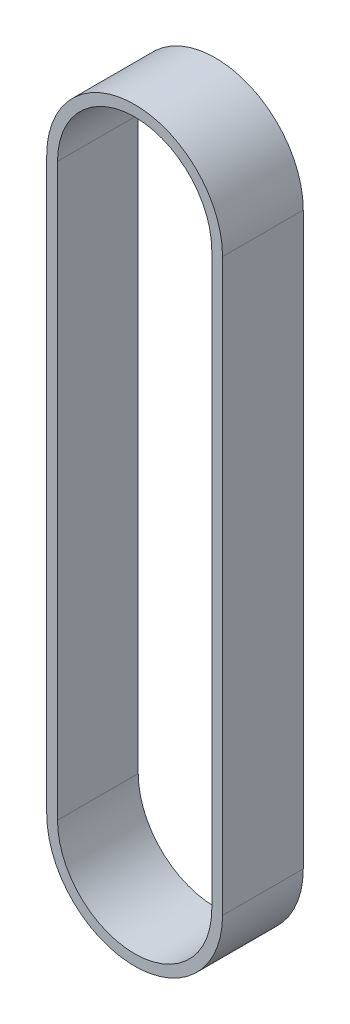
ISO-10303-21;
HEADER;
FILE_DESCRIPTION(('STEP AP214'),'2;1');
FILE_NAME('part.step','',(''),(''),'','','');
FILE_SCHEMA(('AUTOMOTIVE_DESIGN { 1 0 10303 214 1 1 1 1 }'));
ENDSEC;
DATA;
#1=APPLICATION_CONTEXT('core data for automotive mechanical design processes');
#2=APPLICATION_PROTOCOL_DEFINITION('international standard','automotive_design',2000,#1);
#3=PRODUCT_CONTEXT('',#1,'mechanical');
#4=PRODUCT('Part','Part','',(#3));
#5=PRODUCT_RELATED_PRODUCT_CATEGORY('part','',(#4));
#6=PRODUCT_DEFINITION_FORMATION('','',#4);
#7=PRODUCT_DEFINITION_CONTEXT('part definition',#1,'design');
#8=PRODUCT_DEFINITION('design','',#6,#7);
#9=PRODUCT_DEFINITION_SHAPE('','',#8);
#10=(LENGTH_UNIT() NAMED_UNIT(*) SI_UNIT(.MILLI.,.METRE.));
#11=(NAMED_UNIT(*) PLANE_ANGLE_UNIT() SI_UNIT($,.RADIAN.));
#12=(NAMED_UNIT(*) SI_UNIT($,.STERADIAN.) SOLID_ANGLE_UNIT());
#13=UNCERTAINTY_MEASURE_WITH_UNIT(LENGTH_MEASURE(1.E-05),#10,'distance_accuracy_value','');
#14=(GEOMETRIC_REPRESENTATION_CONTEXT(3) GLOBAL_UNCERTAINTY_ASSIGNED_CONTEXT((#13)) GLOBAL_UNIT_ASSIGNED_CONTEXT((#10,
#11,#12)) REPRESENTATION_CONTEXT('',''));
#15=CARTESIAN_POINT('',(0.,0.,0.));
#16=DIRECTION('',(0.,0.,1.));
#17=DIRECTION('',(1.,0.,0.));
#18=AXIS2_PLACEMENT_3D('',#15,#16,#17);
#19=CARTESIAN_POINT('',(0.,-53.,7.5));
#20=DIRECTION('',(0.,0.,1.));
#21=DIRECTION('',(1.,0.,0.));
#22=AXIS2_PLACEMENT_3D('',#19,#20,#21);
#23=PLANE('',#22);
#24=CARTESIAN_POINT('',(0.,-53.,7.5));
#25=DIRECTION('',(0.,0.,1.));
#26=DIRECTION('',(1.,0.,0.));
#27=AXIS2_PLACEMENT_3D('',#24,#25,#26);
#28=CIRCLE('',#27,16.33);
#29=CARTESIAN_POINT('',(-16.33,-53.,7.5));
#30=VERTEX_POINT('',#29);
#31=CARTESIAN_POINT('',(16.33,-53.,7.5));
#32=VERTEX_POINT('',#31);
#33=EDGE_CURVE('E159',#30,#32,#28,.T.);
#34=ORIENTED_EDGE('',*,*,#33,.T.);
#35=DIRECTION('',(0.,1.,0.));
#36=VECTOR('',#35,1.);
#37=CARTESIAN_POINT('',(16.33,-53.,7.5));
#38=LINE('',#37,#36);
#39=CARTESIAN_POINT('',(16.33,53.,7.5));
#40=VERTEX_POINT('',#39);
#41=EDGE_CURVE('E162',#32,#40,#38,.T.);
#42=ORIENTED_EDGE('',*,*,#41,.T.);
#43=CARTESIAN_POINT('',(0.,53.,7.5));
#44=DIRECTION('',(0.,0.,1.));
#45=DIRECTION('',(1.,0.,0.));
#46=AXIS2_PLACEMENT_3D('',#43,#44,#45);
#47=CIRCLE('',#46,16.33);
#48=CARTESIAN_POINT('',(-16.33,53.,7.5));
#49=VERTEX_POINT('',#48);
#50=EDGE_CURVE('E165',#40,#49,#47,.T.);
#51=ORIENTED_EDGE('',*,*,#50,.T.);
#52=DIRECTION('',(0.,-1.,0.));
#53=VECTOR('',#52,1.);
#54=CARTESIAN_POINT('',(-16.33,-53.,7.5));
#55=LINE('',#54,#53);
#56=EDGE_CURVE('E167',#49,#30,#55,.T.);
#57=ORIENTED_EDGE('',*,*,#56,.T.);
#58=EDGE_LOOP('',(#34,#42,#51,#57));
#59=FACE_BOUND('',#58,.T.);
#60=DIRECTION('',(0.,1.,0.));
#61=VECTOR('',#60,1.);
#62=CARTESIAN_POINT('',(14.33,-53.,7.5));
#63=LINE('',#62,#61);
#64=CARTESIAN_POINT('',(14.33,-53.,7.5));
#65=VERTEX_POINT('',#64);
#66=CARTESIAN_POINT('',(14.33,53.,7.5));
#67=VERTEX_POINT('',#66);
#68=EDGE_CURVE('E131',#65,#67,#63,.T.);
#69=ORIENTED_EDGE('',*,*,#68,.F.);
#70=CARTESIAN_POINT('',(0.,-53.,7.5));
#71=DIRECTION('',(0.,0.,1.));
#72=DIRECTION('',(1.,0.,0.));
#73=AXIS2_PLACEMENT_3D('',#70,#71,#72);
#74=CIRCLE('',#73,14.33);
#75=CARTESIAN_POINT('',(-14.33,-53.,7.5));
#76=VERTEX_POINT('',#75);
#77=EDGE_CURVE('E123',#76,#65,#74,.T.);
#78=ORIENTED_EDGE('',*,*,#77,.F.);
#79=DIRECTION('',(0.,-1.,0.));
#80=VECTOR('',#79,1.);
#81=CARTESIAN_POINT('',(-14.33,-53.,7.5));
#82=LINE('',#81,#80);
#83=CARTESIAN_POINT('',(-14.33,53.,7.5));
#84=VERTEX_POINT('',#83);
#85=EDGE_CURVE('E145',#84,#76,#82,.T.);
#86=ORIENTED_EDGE('',*,*,#85,.F.);
#87=CARTESIAN_POINT('',(0.,53.,7.5));
#88=DIRECTION('',(0.,0.,1.));
#89=DIRECTION('',(1.,0.,0.));
#90=AXIS2_PLACEMENT_3D('',#87,#88,#89);
#91=CIRCLE('',#90,14.33);
#92=EDGE_CURVE('E143',#67,#84,#91,.T.);
#93=ORIENTED_EDGE('',*,*,#92,.F.);
#94=EDGE_LOOP('',(#69,#78,#86,#93));
#95=FACE_BOUND('',#94,.T.);
#96=ADVANCED_FACE('F58',(#59,#95),#23,.T.);
#97=CARTESIAN_POINT('',(0.,-53.,-7.5));
#98=DIRECTION('',(0.,0.,1.));
#99=DIRECTION('',(1.,0.,0.));
#100=AXIS2_PLACEMENT_3D('',#97,#98,#99);
#101=PLANE('',#100);
#102=CARTESIAN_POINT('',(0.,-53.,-7.5));
#103=DIRECTION('',(0.,0.,1.));
#104=DIRECTION('',(1.,0.,0.));
#105=AXIS2_PLACEMENT_3D('',#102,#103,#104);
#106=CIRCLE('',#105,16.33);
#107=CARTESIAN_POINT('',(-16.33,-53.,-7.5));
#108=VERTEX_POINT('',#107);
#109=CARTESIAN_POINT('',(16.33,-53.,-7.5));
#110=VERTEX_POINT('',#109);
#111=EDGE_CURVE('E139',#108,#110,#106,.T.);
#112=ORIENTED_EDGE('',*,*,#111,.F.);
#113=DIRECTION('',(0.,-1.,0.));
#114=VECTOR('',#113,1.);
#115=CARTESIAN_POINT('',(-16.33,-53.,-7.5));
#116=LINE('',#115,#114);
#117=CARTESIAN_POINT('',(-16.33,53.,-7.5));
#118=VERTEX_POINT('',#117);
#119=EDGE_CURVE('E163',#118,#108,#116,.T.);
#120=ORIENTED_EDGE('',*,*,#119,.F.);
#121=CARTESIAN_POINT('',(0.,53.,-7.5));
#122=DIRECTION('',(0.,0.,1.));
#123=DIRECTION('',(1.,0.,0.));
#124=AXIS2_PLACEMENT_3D('',#121,#122,#123);
#125=CIRCLE('',#124,16.33);
#126=CARTESIAN_POINT('',(16.33,53.,-7.5));
#127=VERTEX_POINT('',#126);
#128=EDGE_CURVE('E174',#127,#118,#125,.T.);
#129=ORIENTED_EDGE('',*,*,#128,.F.);
#130=DIRECTION('',(0.,1.,0.));
#131=VECTOR('',#130,1.);
#132=CARTESIAN_POINT('',(16.33,-53.,-7.5));
#133=LINE('',#132,#131);
#134=EDGE_CURVE('E172',#110,#127,#133,.T.);
#135=ORIENTED_EDGE('',*,*,#134,.F.);
#136=EDGE_LOOP('',(#112,#120,#129,#135));
#137=FACE_BOUND('',#136,.T.);
#138=CARTESIAN_POINT('',(0.,-53.,-7.5));
#139=DIRECTION('',(0.,0.,1.));
#140=DIRECTION('',(1.,0.,0.));
#141=AXIS2_PLACEMENT_3D('',#138,#139,#140);
#142=CIRCLE('',#141,14.33);
#143=CARTESIAN_POINT('',(-14.33,-53.,-7.5));
#144=VERTEX_POINT('',#143);
#145=CARTESIAN_POINT('',(14.33,-53.,-7.5));
#146=VERTEX_POINT('',#145);
#147=EDGE_CURVE('E81',#144,#146,#142,.T.);
#148=ORIENTED_EDGE('',*,*,#147,.T.);
#149=DIRECTION('',(0.,1.,0.));
#150=VECTOR('',#149,1.);
#151=CARTESIAN_POINT('',(14.33,-53.,-7.5));
#152=LINE('',#151,#150);
#153=CARTESIAN_POINT('',(14.33,53.,-7.5));
#154=VERTEX_POINT('',#153);
#155=EDGE_CURVE('E138',#146,#154,#152,.T.);
#156=ORIENTED_EDGE('',*,*,#155,.T.);
#157=CARTESIAN_POINT('',(0.,53.,-7.5));
#158=DIRECTION('',(0.,0.,1.));
#159=DIRECTION('',(1.,0.,0.));
#160=AXIS2_PLACEMENT_3D('',#157,#158,#159);
#161=CIRCLE('',#160,14.33);
#162=CARTESIAN_POINT('',(-14.33,53.,-7.5));
#163=VERTEX_POINT('',#162);
#164=EDGE_CURVE('E151',#154,#163,#161,.T.);
#165=ORIENTED_EDGE('',*,*,#164,.T.);
#166=DIRECTION('',(0.,-1.,0.));
#167=VECTOR('',#166,1.);
#168=CARTESIAN_POINT('',(-14.33,-53.,-7.5));
#169=LINE('',#168,#167);
#170=EDGE_CURVE('E132',#163,#144,#169,.T.);
#171=ORIENTED_EDGE('',*,*,#170,.T.);
#172=EDGE_LOOP('',(#148,#156,#165,#171));
#173=FACE_BOUND('',#172,.T.);
#174=ADVANCED_FACE('F192',(#137,#173),#101,.F.);
#175=CARTESIAN_POINT('',(0.,-53.,7.5));
#176=DIRECTION('',(0.,0.,-1.));
#177=DIRECTION('',(-1.,0.,0.));
#178=AXIS2_PLACEMENT_3D('',#175,#176,#177);
#179=CYLINDRICAL_SURFACE('',#178,16.33);
#180=ORIENTED_EDGE('',*,*,#111,.T.);
#181=DIRECTION('',(0.,0.,-1.));
#182=VECTOR('',#181,1.);
#183=CARTESIAN_POINT('',(16.33,-53.,7.5));
#184=LINE('',#183,#182);
#185=EDGE_CURVE('E12',#32,#110,#184,.T.);
#186=ORIENTED_EDGE('',*,*,#185,.F.);
#187=ORIENTED_EDGE('',*,*,#33,.F.);
#188=DIRECTION('',(0.,0.,-1.));
#189=VECTOR('',#188,1.);
#190=CARTESIAN_POINT('',(-16.33,-53.,7.5));
#191=LINE('',#190,#189);
#192=EDGE_CURVE('E169',#30,#108,#191,.T.);
#193=ORIENTED_EDGE('',*,*,#192,.T.);
#194=EDGE_LOOP('',(#180,#186,#187,#193));
#195=FACE_BOUND('',#194,.T.);
#196=ADVANCED_FACE('F60',(#195),#179,.T.);
#197=CARTESIAN_POINT('',(16.33,-53.,7.5));
#198=DIRECTION('',(-1.,0.,0.));
#199=DIRECTION('',(0.,-1.,0.));
#200=AXIS2_PLACEMENT_3D('',#197,#198,#199);
#201=PLANE('',#200);
#202=ORIENTED_EDGE('',*,*,#134,.T.);
#203=DIRECTION('',(0.,0.,-1.));
#204=VECTOR('',#203,1.);
#205=CARTESIAN_POINT('',(16.33,53.,7.5));
#206=LINE('',#205,#204);
#207=EDGE_CURVE('E66',#40,#127,#206,.T.);
#208=ORIENTED_EDGE('',*,*,#207,.F.);
#209=ORIENTED_EDGE('',*,*,#41,.F.);
#210=ORIENTED_EDGE('',*,*,#185,.T.);
#211=EDGE_LOOP('',(#202,#208,#209,#210));
#212=FACE_BOUND('',#211,.T.);
#213=ADVANCED_FACE('F202',(#212),#201,.F.);
#214=CARTESIAN_POINT('',(0.,53.,7.5));
#215=DIRECTION('',(0.,0.,-1.));
#216=DIRECTION('',(-1.,0.,0.));
#217=AXIS2_PLACEMENT_3D('',#214,#215,#216);
#218=CYLINDRICAL_SURFACE('',#217,16.33);
#219=ORIENTED_EDGE('',*,*,#128,.T.);
#220=DIRECTION('',(0.,0.,-1.));
#221=VECTOR('',#220,1.);
#222=CARTESIAN_POINT('',(-16.33,53.,7.5));
#223=LINE('',#222,#221);
#224=EDGE_CURVE('E179',#49,#118,#223,.T.);
#225=ORIENTED_EDGE('',*,*,#224,.F.);
#226=ORIENTED_EDGE('',*,*,#50,.F.);
#227=ORIENTED_EDGE('',*,*,#207,.T.);
#228=EDGE_LOOP('',(#219,#225,#226,#227));
#229=FACE_BOUND('',#228,.T.);
#230=ADVANCED_FACE('F186',(#229),#218,.T.);
#231=CARTESIAN_POINT('',(-16.33,-53.,7.5));
#232=DIRECTION('',(1.,0.,0.));
#233=DIRECTION('',(0.,1.,0.));
#234=AXIS2_PLACEMENT_3D('',#231,#232,#233);
#235=PLANE('',#234);
#236=ORIENTED_EDGE('',*,*,#119,.T.);
#237=ORIENTED_EDGE('',*,*,#192,.F.);
#238=ORIENTED_EDGE('',*,*,#56,.F.);
#239=ORIENTED_EDGE('',*,*,#224,.T.);
#240=EDGE_LOOP('',(#236,#237,#238,#239));
#241=FACE_BOUND('',#240,.T.);
#242=ADVANCED_FACE('F196',(#241),#235,.F.);
#243=CARTESIAN_POINT('',(0.,-53.,7.5));
#244=DIRECTION('',(0.,0.,-1.));
#245=DIRECTION('',(-1.,0.,0.));
#246=AXIS2_PLACEMENT_3D('',#243,#244,#245);
#247=CYLINDRICAL_SURFACE('',#246,14.33);
#248=ORIENTED_EDGE('',*,*,#147,.F.);
#249=DIRECTION('',(0.,0.,-1.));
#250=VECTOR('',#249,1.);
#251=CARTESIAN_POINT('',(-14.33,-53.,7.5));
#252=LINE('',#251,#250);
#253=EDGE_CURVE('E127',#76,#144,#252,.T.);
#254=ORIENTED_EDGE('',*,*,#253,.F.);
#255=ORIENTED_EDGE('',*,*,#77,.T.);
#256=DIRECTION('',(0.,0.,-1.));
#257=VECTOR('',#256,1.);
#258=CARTESIAN_POINT('',(14.33,-53.,7.5));
#259=LINE('',#258,#257);
#260=EDGE_CURVE('E126',#65,#146,#259,.T.);
#261=ORIENTED_EDGE('',*,*,#260,.T.);
#262=EDGE_LOOP('',(#248,#254,#255,#261));
#263=FACE_BOUND('',#262,.T.);
#264=ADVANCED_FACE('F125',(#263),#247,.F.);
#265=CARTESIAN_POINT('',(14.33,-53.,7.5));
#266=DIRECTION('',(-1.,0.,0.));
#267=DIRECTION('',(0.,-1.,0.));
#268=AXIS2_PLACEMENT_3D('',#265,#266,#267);
#269=PLANE('',#268);
#270=ORIENTED_EDGE('',*,*,#155,.F.);
#271=ORIENTED_EDGE('',*,*,#260,.F.);
#272=ORIENTED_EDGE('',*,*,#68,.T.);
#273=DIRECTION('',(0.,0.,-1.));
#274=VECTOR('',#273,1.);
#275=CARTESIAN_POINT('',(14.33,53.,7.5));
#276=LINE('',#275,#274);
#277=EDGE_CURVE('E140',#67,#154,#276,.T.);
#278=ORIENTED_EDGE('',*,*,#277,.T.);
#279=EDGE_LOOP('',(#270,#271,#272,#278));
#280=FACE_BOUND('',#279,.T.);
#281=ADVANCED_FACE('F135',(#280),#269,.T.);
#282=CARTESIAN_POINT('',(0.,53.,7.5));
#283=DIRECTION('',(0.,0.,-1.));
#284=DIRECTION('',(-1.,0.,0.));
#285=AXIS2_PLACEMENT_3D('',#282,#283,#284);
#286=CYLINDRICAL_SURFACE('',#285,14.33);
#287=ORIENTED_EDGE('',*,*,#164,.F.);
#288=ORIENTED_EDGE('',*,*,#277,.F.);
#289=ORIENTED_EDGE('',*,*,#92,.T.);
#290=DIRECTION('',(0.,0.,-1.));
#291=VECTOR('',#290,1.);
#292=CARTESIAN_POINT('',(-14.33,53.,7.5));
#293=LINE('',#292,#291);
#294=EDGE_CURVE('E73',#84,#163,#293,.T.);
#295=ORIENTED_EDGE('',*,*,#294,.T.);
#296=EDGE_LOOP('',(#287,#288,#289,#295));
#297=FACE_BOUND('',#296,.T.);
#298=ADVANCED_FACE('F225',(#297),#286,.F.);
#299=CARTESIAN_POINT('',(-14.33,-53.,7.5));
#300=DIRECTION('',(1.,0.,0.));
#301=DIRECTION('',(0.,1.,0.));
#302=AXIS2_PLACEMENT_3D('',#299,#300,#301);
#303=PLANE('',#302);
#304=ORIENTED_EDGE('',*,*,#170,.F.);
#305=ORIENTED_EDGE('',*,*,#294,.F.);
#306=ORIENTED_EDGE('',*,*,#85,.T.);
#307=ORIENTED_EDGE('',*,*,#253,.T.);
#308=EDGE_LOOP('',(#304,#305,#306,#307));
#309=FACE_BOUND('',#308,.T.);
#310=ADVANCED_FACE('F229',(#309),#303,.T.);
#311=CLOSED_SHELL('',(#96,#174,#196,#213,#230,#242,#264,#281,#298,#310));
#312=MANIFOLD_SOLID_BREP('B2',#311);
#313=ADVANCED_BREP_SHAPE_REPRESENTATION('',(#18,#312),#14);
#314=SHAPE_DEFINITION_REPRESENTATION(#9,#313);
ENDSEC;
END-ISO-10303-21;
